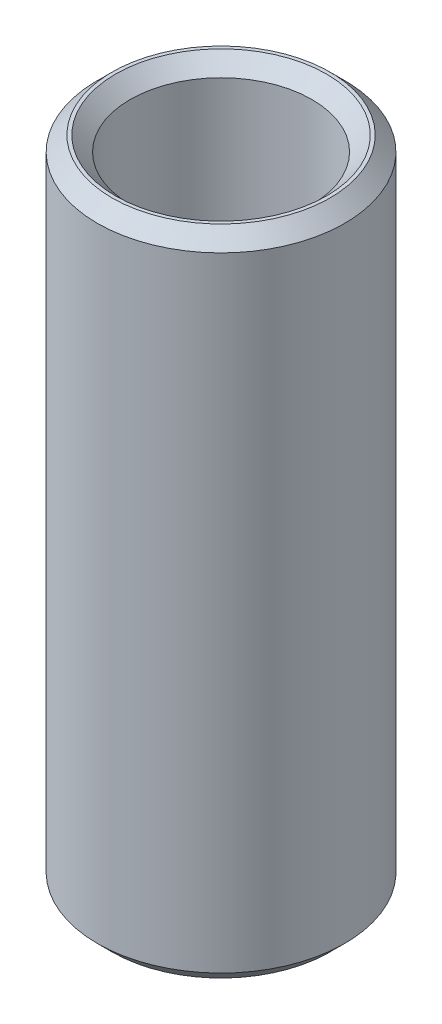
ISO-10303-21;
HEADER;
FILE_DESCRIPTION(('STEP AP214'),'2;1');
FILE_NAME('part.step','',(''),(''),'','','');
FILE_SCHEMA(('AUTOMOTIVE_DESIGN { 1 0 10303 214 1 1 1 1 }'));
ENDSEC;
DATA;
#1=APPLICATION_CONTEXT('core data for automotive mechanical design processes');
#2=APPLICATION_PROTOCOL_DEFINITION('international standard','automotive_design',2000,#1);
#3=PRODUCT_CONTEXT('',#1,'mechanical');
#4=PRODUCT('Part','Part','',(#3));
#5=PRODUCT_RELATED_PRODUCT_CATEGORY('part','',(#4));
#6=PRODUCT_DEFINITION_FORMATION('','',#4);
#7=PRODUCT_DEFINITION_CONTEXT('part definition',#1,'design');
#8=PRODUCT_DEFINITION('design','',#6,#7);
#9=PRODUCT_DEFINITION_SHAPE('','',#8);
#10=(LENGTH_UNIT() NAMED_UNIT(*) SI_UNIT(.MILLI.,.METRE.));
#11=(NAMED_UNIT(*) PLANE_ANGLE_UNIT() SI_UNIT($,.RADIAN.));
#12=(NAMED_UNIT(*) SI_UNIT($,.STERADIAN.) SOLID_ANGLE_UNIT());
#13=UNCERTAINTY_MEASURE_WITH_UNIT(LENGTH_MEASURE(1.E-05),#10,'distance_accuracy_value','');
#14=(GEOMETRIC_REPRESENTATION_CONTEXT(3) GLOBAL_UNCERTAINTY_ASSIGNED_CONTEXT((#13)) GLOBAL_UNIT_ASSIGNED_CONTEXT((#10,
#11,#12)) REPRESENTATION_CONTEXT('',''));
#15=CARTESIAN_POINT('',(0.,0.,0.));
#16=DIRECTION('',(0.,0.,1.));
#17=DIRECTION('',(1.,0.,0.));
#18=AXIS2_PLACEMENT_3D('',#15,#16,#17);
#19=CARTESIAN_POINT('',(0.,52.7964421743603,0.));
#20=DIRECTION('',(0.,-1.,0.));
#21=DIRECTION('',(0.,0.,-1.));
#22=AXIS2_PLACEMENT_3D('',#19,#20,#21);
#23=CYLINDRICAL_SURFACE('',#22,10.);
#24=CARTESIAN_POINT('',(0.,1.1857037049939,0.));
#25=DIRECTION('',(0.,1.,0.));
#26=DIRECTION('',(0.,0.,1.));
#27=AXIS2_PLACEMENT_3D('',#24,#25,#26);
#28=CIRCLE('',#27,10.);
#29=CARTESIAN_POINT('',(0.,1.1857037049939,10.));
#30=VERTEX_POINT('',#29);
#31=EDGE_CURVE('E10',#30,#30,#28,.T.);
#32=ORIENTED_EDGE('',*,*,#31,.T.);
#33=EDGE_LOOP('',(#32));
#34=FACE_BOUND('',#33,.T.);
#35=CARTESIAN_POINT('',(0.,51.6107384693664,0.));
#36=DIRECTION('',(0.,1.,0.));
#37=DIRECTION('',(0.,0.,1.));
#38=AXIS2_PLACEMENT_3D('',#35,#36,#37);
#39=CIRCLE('',#38,10.);
#40=CARTESIAN_POINT('',(0.,51.6107384693664,10.));
#41=VERTEX_POINT('',#40);
#42=EDGE_CURVE('E50',#41,#41,#39,.F.);
#43=ORIENTED_EDGE('',*,*,#42,.T.);
#44=EDGE_LOOP('',(#43));
#45=FACE_BOUND('',#44,.T.);
#46=ADVANCED_FACE('F39',(#34,#45),#23,.T.);
#47=CARTESIAN_POINT('',(0.,52.7964421743603,0.));
#48=DIRECTION('',(0.,1.,0.));
#49=DIRECTION('',(0.,0.,1.));
#50=AXIS2_PLACEMENT_3D('',#47,#48,#49);
#51=PLANE('',#50);
#52=CARTESIAN_POINT('',(0.,52.7964421743603,0.));
#53=DIRECTION('',(0.,1.,0.));
#54=DIRECTION('',(0.,0.,1.));
#55=AXIS2_PLACEMENT_3D('',#52,#53,#54);
#56=CIRCLE('',#55,8.53403579835273);
#57=CARTESIAN_POINT('',(0.,52.7964421743603,8.53403579835273));
#58=VERTEX_POINT('',#57);
#59=EDGE_CURVE('E58',#58,#58,#56,.F.);
#60=ORIENTED_EDGE('',*,*,#59,.T.);
#61=EDGE_LOOP('',(#60));
#62=FACE_BOUND('',#61,.T.);
#63=CARTESIAN_POINT('',(0.,52.7964421743603,0.));
#64=DIRECTION('',(0.,1.,0.));
#65=DIRECTION('',(0.,0.,1.));
#66=AXIS2_PLACEMENT_3D('',#63,#64,#65);
#67=CIRCLE('',#66,8.81429629500612);
#68=CARTESIAN_POINT('',(0.,52.7964421743603,8.81429629500612));
#69=VERTEX_POINT('',#68);
#70=EDGE_CURVE('E61',#69,#69,#67,.T.);
#71=ORIENTED_EDGE('',*,*,#70,.T.);
#72=EDGE_LOOP('',(#71));
#73=FACE_BOUND('',#72,.T.);
#74=ADVANCED_FACE('F88',(#62,#73),#51,.T.);
#75=CARTESIAN_POINT('',(0.,0.,0.));
#76=DIRECTION('',(0.,1.,0.));
#77=DIRECTION('',(0.,0.,1.));
#78=AXIS2_PLACEMENT_3D('',#75,#76,#77);
#79=PLANE('',#78);
#80=CARTESIAN_POINT('',(0.,0.,0.));
#81=DIRECTION('',(0.,1.,0.));
#82=DIRECTION('',(0.,0.,1.));
#83=AXIS2_PLACEMENT_3D('',#80,#81,#82);
#84=CIRCLE('',#83,8.53403579835272);
#85=CARTESIAN_POINT('',(0.,0.,8.53403579835272));
#86=VERTEX_POINT('',#85);
#87=EDGE_CURVE('E51',#86,#86,#84,.T.);
#88=ORIENTED_EDGE('',*,*,#87,.T.);
#89=EDGE_LOOP('',(#88));
#90=FACE_BOUND('',#89,.T.);
#91=CARTESIAN_POINT('',(0.,0.,0.));
#92=DIRECTION('',(0.,1.,0.));
#93=DIRECTION('',(0.,0.,1.));
#94=AXIS2_PLACEMENT_3D('',#91,#92,#93);
#95=CIRCLE('',#94,8.81429629500609);
#96=CARTESIAN_POINT('',(0.,0.,8.81429629500609));
#97=VERTEX_POINT('',#96);
#98=EDGE_CURVE('E54',#97,#97,#95,.F.);
#99=ORIENTED_EDGE('',*,*,#98,.T.);
#100=EDGE_LOOP('',(#99));
#101=FACE_BOUND('',#100,.T.);
#102=ADVANCED_FACE('F83',(#90,#101),#79,.F.);
#103=CARTESIAN_POINT('',(0.,52.7964421743603,0.));
#104=DIRECTION('',(0.,-1.,0.));
#105=DIRECTION('',(0.,0.,-1.));
#106=AXIS2_PLACEMENT_3D('',#103,#104,#105);
#107=CYLINDRICAL_SURFACE('',#106,7.34833209335884);
#108=CARTESIAN_POINT('',(0.,51.6107384693664,0.));
#109=DIRECTION('',(0.,1.,0.));
#110=DIRECTION('',(0.,0.,1.));
#111=AXIS2_PLACEMENT_3D('',#108,#109,#110);
#112=CIRCLE('',#111,7.34833209335884);
#113=CARTESIAN_POINT('',(0.,51.6107384693664,7.34833209335884));
#114=VERTEX_POINT('',#113);
#115=EDGE_CURVE('E67',#114,#114,#112,.T.);
#116=ORIENTED_EDGE('',*,*,#115,.T.);
#117=EDGE_LOOP('',(#116));
#118=FACE_BOUND('',#117,.T.);
#119=CARTESIAN_POINT('',(0.,1.1857037049939,0.));
#120=DIRECTION('',(0.,1.,0.));
#121=DIRECTION('',(0.,0.,1.));
#122=AXIS2_PLACEMENT_3D('',#119,#120,#121);
#123=CIRCLE('',#122,7.34833209335884);
#124=CARTESIAN_POINT('',(0.,1.1857037049939,7.34833209335884));
#125=VERTEX_POINT('',#124);
#126=EDGE_CURVE('E69',#125,#125,#123,.F.);
#127=ORIENTED_EDGE('',*,*,#126,.T.);
#128=EDGE_LOOP('',(#127));
#129=FACE_BOUND('',#128,.T.);
#130=ADVANCED_FACE('F71',(#118,#129),#107,.F.);
#131=CARTESIAN_POINT('',(0.,51.6107384693664,0.));
#132=DIRECTION('',(0.,1.,0.));
#133=DIRECTION('',(0.,0.,1.));
#134=AXIS2_PLACEMENT_3D('',#131,#132,#133);
#135=CONICAL_SURFACE('',#134,7.34833209335884,0.785398163397455);
#136=ORIENTED_EDGE('',*,*,#59,.F.);
#137=EDGE_LOOP('',(#136));
#138=FACE_BOUND('',#137,.T.);
#139=ORIENTED_EDGE('',*,*,#115,.F.);
#140=EDGE_LOOP('',(#139));
#141=FACE_BOUND('',#140,.T.);
#142=ADVANCED_FACE('F77',(#138,#141),#135,.F.);
#143=CARTESIAN_POINT('',(0.,0.,0.));
#144=DIRECTION('',(0.,-1.,0.));
#145=DIRECTION('',(0.,0.,-1.));
#146=AXIS2_PLACEMENT_3D('',#143,#144,#145);
#147=CONICAL_SURFACE('',#146,8.53403579835272,0.785398163397441);
#148=ORIENTED_EDGE('',*,*,#126,.F.);
#149=EDGE_LOOP('',(#148));
#150=FACE_BOUND('',#149,.T.);
#151=ORIENTED_EDGE('',*,*,#87,.F.);
#152=EDGE_LOOP('',(#151));
#153=FACE_BOUND('',#152,.T.);
#154=ADVANCED_FACE('F73',(#150,#153),#147,.F.);
#155=CARTESIAN_POINT('',(0.,1.1857037049939,0.));
#156=DIRECTION('',(0.,1.,0.));
#157=DIRECTION('',(0.,0.,1.));
#158=AXIS2_PLACEMENT_3D('',#155,#156,#157);
#159=CONICAL_SURFACE('',#158,10.,0.785398163397451);
#160=ORIENTED_EDGE('',*,*,#98,.F.);
#161=EDGE_LOOP('',(#160));
#162=FACE_BOUND('',#161,.T.);
#163=ORIENTED_EDGE('',*,*,#31,.F.);
#164=EDGE_LOOP('',(#163));
#165=FACE_BOUND('',#164,.T.);
#166=ADVANCED_FACE('F76',(#162,#165),#159,.T.);
#167=CARTESIAN_POINT('',(0.,52.7964421743603,0.));
#168=DIRECTION('',(0.,-1.,0.));
#169=DIRECTION('',(0.,0.,-1.));
#170=AXIS2_PLACEMENT_3D('',#167,#168,#169);
#171=CONICAL_SURFACE('',#170,8.81429629500612,0.785398163397445);
#172=ORIENTED_EDGE('',*,*,#42,.F.);
#173=EDGE_LOOP('',(#172));
#174=FACE_BOUND('',#173,.T.);
#175=ORIENTED_EDGE('',*,*,#70,.F.);
#176=EDGE_LOOP('',(#175));
#177=FACE_BOUND('',#176,.T.);
#178=ADVANCED_FACE('F45',(#174,#177),#171,.T.);
#179=CLOSED_SHELL('',(#46,#74,#102,#130,#142,#154,#166,#178));
#180=MANIFOLD_SOLID_BREP('B2',#179);
#181=ADVANCED_BREP_SHAPE_REPRESENTATION('',(#18,#180),#14);
#182=SHAPE_DEFINITION_REPRESENTATION(#9,#181);
ENDSEC;
END-ISO-10303-21;
